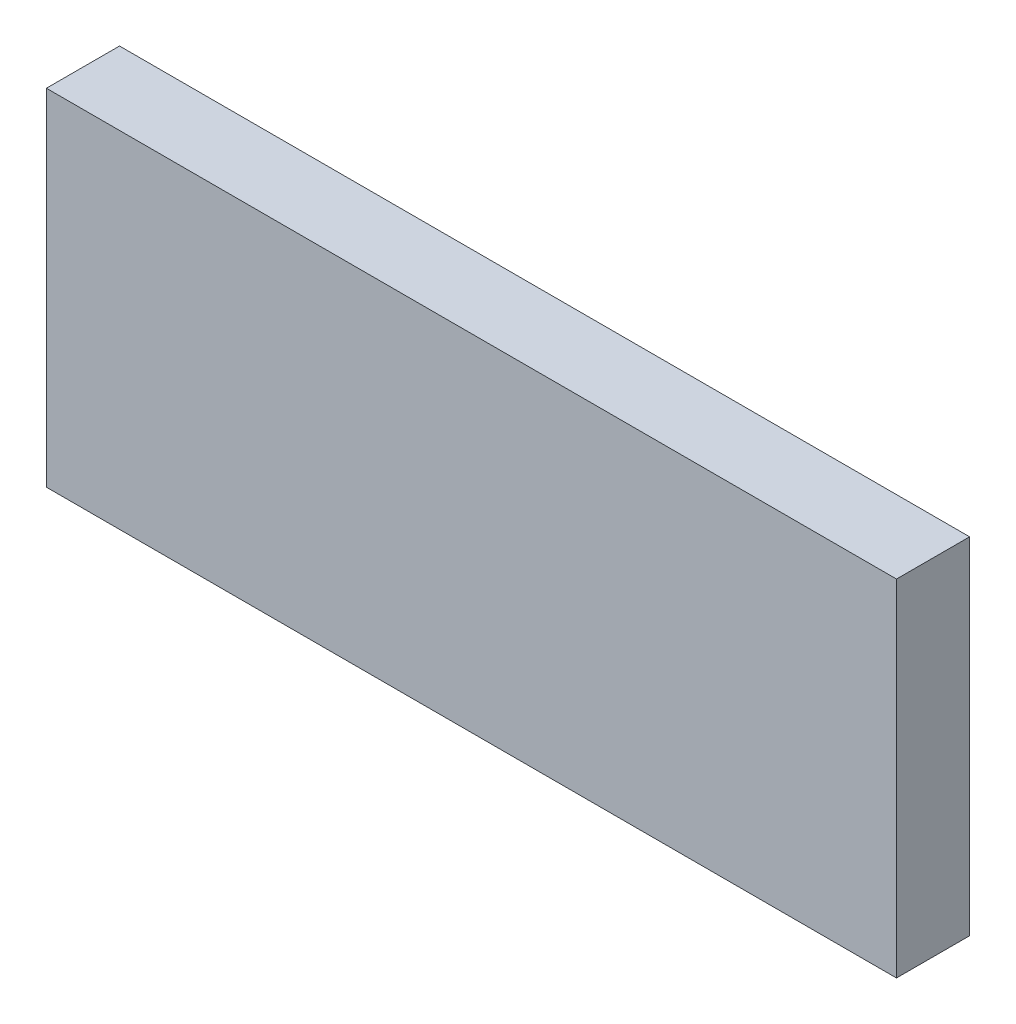
ISO-10303-21;
HEADER;
FILE_DESCRIPTION(('STEP AP214'),'2;1');
FILE_NAME('part.step','',(''),(''),'','','');
FILE_SCHEMA(('AUTOMOTIVE_DESIGN { 1 0 10303 214 1 1 1 1 }'));
ENDSEC;
DATA;
#1=APPLICATION_CONTEXT('core data for automotive mechanical design processes');
#2=APPLICATION_PROTOCOL_DEFINITION('international standard','automotive_design',2000,#1);
#3=PRODUCT_CONTEXT('',#1,'mechanical');
#4=PRODUCT('Part','Part','',(#3));
#5=PRODUCT_RELATED_PRODUCT_CATEGORY('part','',(#4));
#6=PRODUCT_DEFINITION_FORMATION('','',#4);
#7=PRODUCT_DEFINITION_CONTEXT('part definition',#1,'design');
#8=PRODUCT_DEFINITION('design','',#6,#7);
#9=PRODUCT_DEFINITION_SHAPE('','',#8);
#10=(LENGTH_UNIT() NAMED_UNIT(*) SI_UNIT(.MILLI.,.METRE.));
#11=(NAMED_UNIT(*) PLANE_ANGLE_UNIT() SI_UNIT($,.RADIAN.));
#12=(NAMED_UNIT(*) SI_UNIT($,.STERADIAN.) SOLID_ANGLE_UNIT());
#13=UNCERTAINTY_MEASURE_WITH_UNIT(LENGTH_MEASURE(1.E-05),#10,'distance_accuracy_value','');
#14=(GEOMETRIC_REPRESENTATION_CONTEXT(3) GLOBAL_UNCERTAINTY_ASSIGNED_CONTEXT((#13)) GLOBAL_UNIT_ASSIGNED_CONTEXT((#10,
#11,#12)) REPRESENTATION_CONTEXT('',''));
#15=CARTESIAN_POINT('',(0.,0.,0.));
#16=DIRECTION('',(0.,0.,1.));
#17=DIRECTION('',(1.,0.,0.));
#18=AXIS2_PLACEMENT_3D('',#15,#16,#17);
#19=CARTESIAN_POINT('',(0.,0.,8.));
#20=DIRECTION('',(-1.,0.,0.));
#21=DIRECTION('',(0.,-1.,0.));
#22=AXIS2_PLACEMENT_3D('',#19,#20,#21);
#23=PLANE('',#22);
#24=DIRECTION('',(0.,1.,0.));
#25=VECTOR('',#24,1.);
#26=CARTESIAN_POINT('',(0.,0.,0.));
#27=LINE('',#26,#25);
#28=CARTESIAN_POINT('',(0.,0.,0.));
#29=VERTEX_POINT('',#28);
#30=CARTESIAN_POINT('',(0.,37.8,0.));
#31=VERTEX_POINT('',#30);
#32=EDGE_CURVE('E107',#29,#31,#27,.T.);
#33=ORIENTED_EDGE('',*,*,#32,.T.);
#34=DIRECTION('',(0.,0.,-1.));
#35=VECTOR('',#34,1.);
#36=CARTESIAN_POINT('',(0.,37.8,8.));
#37=LINE('',#36,#35);
#38=CARTESIAN_POINT('',(0.,37.8,8.));
#39=VERTEX_POINT('',#38);
#40=EDGE_CURVE('E11',#39,#31,#37,.T.);
#41=ORIENTED_EDGE('',*,*,#40,.F.);
#42=DIRECTION('',(0.,1.,0.));
#43=VECTOR('',#42,1.);
#44=CARTESIAN_POINT('',(0.,0.,8.));
#45=LINE('',#44,#43);
#46=CARTESIAN_POINT('',(0.,0.,8.));
#47=VERTEX_POINT('',#46);
#48=EDGE_CURVE('E91',#47,#39,#45,.T.);
#49=ORIENTED_EDGE('',*,*,#48,.F.);
#50=DIRECTION('',(0.,0.,-1.));
#51=VECTOR('',#50,1.);
#52=CARTESIAN_POINT('',(0.,0.,8.));
#53=LINE('',#52,#51);
#54=EDGE_CURVE('E103',#47,#29,#53,.T.);
#55=ORIENTED_EDGE('',*,*,#54,.T.);
#56=EDGE_LOOP('',(#33,#41,#49,#55));
#57=FACE_BOUND('',#56,.T.);
#58=ADVANCED_FACE('F39',(#57),#23,.F.);
#59=CARTESIAN_POINT('',(0.,37.8,8.));
#60=DIRECTION('',(0.,-1.,0.));
#61=DIRECTION('',(1.,0.,0.));
#62=AXIS2_PLACEMENT_3D('',#59,#60,#61);
#63=PLANE('',#62);
#64=DIRECTION('',(-1.,0.,0.));
#65=VECTOR('',#64,1.);
#66=CARTESIAN_POINT('',(0.,37.8,0.));
#67=LINE('',#66,#65);
#68=CARTESIAN_POINT('',(-93.,37.8,0.));
#69=VERTEX_POINT('',#68);
#70=EDGE_CURVE('E96',#31,#69,#67,.T.);
#71=ORIENTED_EDGE('',*,*,#70,.T.);
#72=DIRECTION('',(0.,0.,-1.));
#73=VECTOR('',#72,1.);
#74=CARTESIAN_POINT('',(-93.,37.8,8.));
#75=LINE('',#74,#73);
#76=CARTESIAN_POINT('',(-93.,37.8,8.));
#77=VERTEX_POINT('',#76);
#78=EDGE_CURVE('E48',#77,#69,#75,.T.);
#79=ORIENTED_EDGE('',*,*,#78,.F.);
#80=DIRECTION('',(-1.,0.,0.));
#81=VECTOR('',#80,1.);
#82=CARTESIAN_POINT('',(0.,37.8,8.));
#83=LINE('',#82,#81);
#84=EDGE_CURVE('E86',#39,#77,#83,.T.);
#85=ORIENTED_EDGE('',*,*,#84,.F.);
#86=ORIENTED_EDGE('',*,*,#40,.T.);
#87=EDGE_LOOP('',(#71,#79,#85,#86));
#88=FACE_BOUND('',#87,.T.);
#89=ADVANCED_FACE('F95',(#88),#63,.F.);
#90=CARTESIAN_POINT('',(-93.,0.,8.));
#91=DIRECTION('',(1.,0.,0.));
#92=DIRECTION('',(0.,0.,-1.));
#93=AXIS2_PLACEMENT_3D('',#90,#91,#92);
#94=PLANE('',#93);
#95=DIRECTION('',(0.,-1.,0.));
#96=VECTOR('',#95,1.);
#97=CARTESIAN_POINT('',(-93.,0.,0.));
#98=LINE('',#97,#96);
#99=CARTESIAN_POINT('',(-93.,0.,0.));
#100=VERTEX_POINT('',#99);
#101=EDGE_CURVE('E73',#69,#100,#98,.T.);
#102=ORIENTED_EDGE('',*,*,#101,.T.);
#103=DIRECTION('',(0.,0.,-1.));
#104=VECTOR('',#103,1.);
#105=CARTESIAN_POINT('',(-93.,0.,8.));
#106=LINE('',#105,#104);
#107=CARTESIAN_POINT('',(-93.,0.,8.));
#108=VERTEX_POINT('',#107);
#109=EDGE_CURVE('E98',#108,#100,#106,.T.);
#110=ORIENTED_EDGE('',*,*,#109,.F.);
#111=DIRECTION('',(0.,-1.,0.));
#112=VECTOR('',#111,1.);
#113=CARTESIAN_POINT('',(-93.,0.,8.));
#114=LINE('',#113,#112);
#115=EDGE_CURVE('E89',#77,#108,#114,.T.);
#116=ORIENTED_EDGE('',*,*,#115,.F.);
#117=ORIENTED_EDGE('',*,*,#78,.T.);
#118=EDGE_LOOP('',(#102,#110,#116,#117));
#119=FACE_BOUND('',#118,.T.);
#120=ADVANCED_FACE('F99',(#119),#94,.F.);
#121=CARTESIAN_POINT('',(0.,0.,8.));
#122=DIRECTION('',(0.,1.,0.));
#123=DIRECTION('',(0.,0.,1.));
#124=AXIS2_PLACEMENT_3D('',#121,#122,#123);
#125=PLANE('',#124);
#126=DIRECTION('',(1.,0.,0.));
#127=VECTOR('',#126,1.);
#128=CARTESIAN_POINT('',(0.,0.,0.));
#129=LINE('',#128,#127);
#130=EDGE_CURVE('E79',#100,#29,#129,.T.);
#131=ORIENTED_EDGE('',*,*,#130,.T.);
#132=ORIENTED_EDGE('',*,*,#54,.F.);
#133=DIRECTION('',(1.,0.,0.));
#134=VECTOR('',#133,1.);
#135=CARTESIAN_POINT('',(0.,0.,8.));
#136=LINE('',#135,#134);
#137=EDGE_CURVE('E56',#108,#47,#136,.T.);
#138=ORIENTED_EDGE('',*,*,#137,.F.);
#139=ORIENTED_EDGE('',*,*,#109,.T.);
#140=EDGE_LOOP('',(#131,#132,#138,#139));
#141=FACE_BOUND('',#140,.T.);
#142=ADVANCED_FACE('F120',(#141),#125,.F.);
#143=CARTESIAN_POINT('',(0.,0.,8.));
#144=DIRECTION('',(0.,0.,1.));
#145=DIRECTION('',(1.,0.,0.));
#146=AXIS2_PLACEMENT_3D('',#143,#144,#145);
#147=PLANE('',#146);
#148=ORIENTED_EDGE('',*,*,#48,.T.);
#149=ORIENTED_EDGE('',*,*,#84,.T.);
#150=ORIENTED_EDGE('',*,*,#115,.T.);
#151=ORIENTED_EDGE('',*,*,#137,.T.);
#152=EDGE_LOOP('',(#148,#149,#150,#151));
#153=FACE_BOUND('',#152,.T.);
#154=ADVANCED_FACE('F87',(#153),#147,.T.);
#155=CARTESIAN_POINT('',(0.,0.,0.));
#156=DIRECTION('',(0.,0.,1.));
#157=DIRECTION('',(1.,0.,0.));
#158=AXIS2_PLACEMENT_3D('',#155,#156,#157);
#159=PLANE('',#158);
#160=ORIENTED_EDGE('',*,*,#32,.F.);
#161=ORIENTED_EDGE('',*,*,#130,.F.);
#162=ORIENTED_EDGE('',*,*,#101,.F.);
#163=ORIENTED_EDGE('',*,*,#70,.F.);
#164=EDGE_LOOP('',(#160,#161,#162,#163));
#165=FACE_BOUND('',#164,.T.);
#166=ADVANCED_FACE('F123',(#165),#159,.F.);
#167=CLOSED_SHELL('',(#58,#89,#120,#142,#154,#166));
#168=MANIFOLD_SOLID_BREP('B2',#167);
#169=ADVANCED_BREP_SHAPE_REPRESENTATION('',(#18,#168),#14);
#170=SHAPE_DEFINITION_REPRESENTATION(#9,#169);
ENDSEC;
END-ISO-10303-21;
